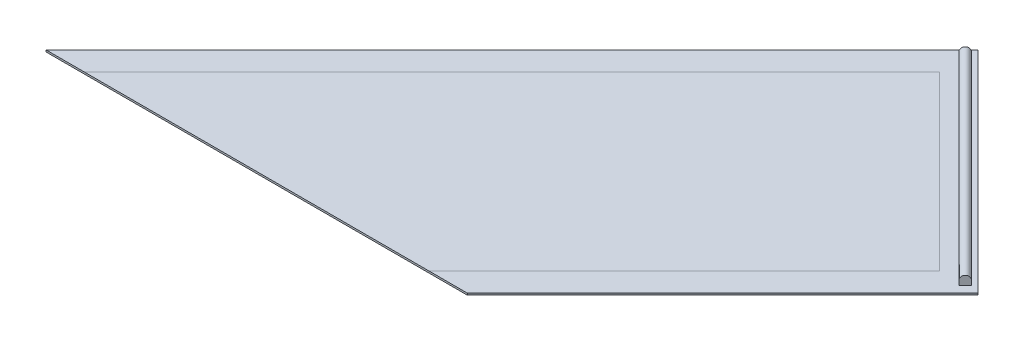
ISO-10303-21;
HEADER;
FILE_DESCRIPTION(('STEP AP214'),'2;1');
FILE_NAME('part.step','',(''),(''),'','','');
FILE_SCHEMA(('AUTOMOTIVE_DESIGN { 1 0 10303 214 1 1 1 1 }'));
ENDSEC;
DATA;
#1=APPLICATION_CONTEXT('core data for automotive mechanical design processes');
#2=APPLICATION_PROTOCOL_DEFINITION('international standard','automotive_design',2000,#1);
#3=PRODUCT_CONTEXT('',#1,'mechanical');
#4=PRODUCT('Part','Part','',(#3));
#5=PRODUCT_RELATED_PRODUCT_CATEGORY('part','',(#4));
#6=PRODUCT_DEFINITION_FORMATION('','',#4);
#7=PRODUCT_DEFINITION_CONTEXT('part definition',#1,'design');
#8=PRODUCT_DEFINITION('design','',#6,#7);
#9=PRODUCT_DEFINITION_SHAPE('','',#8);
#10=(LENGTH_UNIT() NAMED_UNIT(*) SI_UNIT(.MILLI.,.METRE.));
#11=(NAMED_UNIT(*) PLANE_ANGLE_UNIT() SI_UNIT($,.RADIAN.));
#12=(NAMED_UNIT(*) SI_UNIT($,.STERADIAN.) SOLID_ANGLE_UNIT());
#13=UNCERTAINTY_MEASURE_WITH_UNIT(LENGTH_MEASURE(1.E-05),#10,'distance_accuracy_value','');
#14=(GEOMETRIC_REPRESENTATION_CONTEXT(3) GLOBAL_UNCERTAINTY_ASSIGNED_CONTEXT((#13)) GLOBAL_UNIT_ASSIGNED_CONTEXT((#10,
#11,#12)) REPRESENTATION_CONTEXT('',''));
#15=CARTESIAN_POINT('',(0.,0.,0.));
#16=DIRECTION('',(0.,0.,1.));
#17=DIRECTION('',(1.,0.,0.));
#18=AXIS2_PLACEMENT_3D('',#15,#16,#17);
#19=CARTESIAN_POINT('',(0.,2.,0.));
#20=DIRECTION('',(0.,1.,0.));
#21=DIRECTION('',(0.,0.,1.));
#22=AXIS2_PLACEMENT_3D('',#19,#20,#21);
#23=PLANE('',#22);
#24=DIRECTION('',(-0.707106781186547,0.,-0.707106781186548));
#25=VECTOR('',#24,1.);
#26=CARTESIAN_POINT('',(-21.2132034355965,2.,21.2132034355964));
#27=LINE('',#26,#25);
#28=CARTESIAN_POINT('',(190.918830920368,2.,233.345237791561));
#29=VERTEX_POINT('',#28);
#30=CARTESIAN_POINT('',(0.,2.,42.4264068711929));
#31=VERTEX_POINT('',#30);
#32=EDGE_CURVE('E50',#29,#31,#27,.T.);
#33=ORIENTED_EDGE('',*,*,#32,.T.);
#34=DIRECTION('',(-0.707106781186548,0.,0.707106781186548));
#35=VECTOR('',#34,1.);
#36=CARTESIAN_POINT('',(21.2132034355964,2.,21.2132034355964));
#37=LINE('',#36,#35);
#38=CARTESIAN_POINT('',(-473.761543394988,2.,516.18795026618));
#39=VERTEX_POINT('',#38);
#40=EDGE_CURVE('E11',#31,#39,#37,.T.);
#41=ORIENTED_EDGE('',*,*,#40,.T.);
#42=DIRECTION('',(1.,0.,0.));
#43=VECTOR('',#42,1.);
#44=CARTESIAN_POINT('',(-516.18795026618,2.,516.18795026618));
#45=LINE('',#44,#43);
#46=CARTESIAN_POINT('',(-91.9238815542521,2.,516.18795026618));
#47=VERTEX_POINT('',#46);
#48=EDGE_CURVE('E139',#39,#47,#45,.T.);
#49=ORIENTED_EDGE('',*,*,#48,.T.);
#50=DIRECTION('',(0.707106781186549,0.,-0.707106781186546));
#51=VECTOR('',#50,1.);
#52=CARTESIAN_POINT('',(212.132034355964,2.,212.132034355965));
#53=LINE('',#52,#51);
#54=EDGE_CURVE('E162',#47,#29,#53,.T.);
#55=ORIENTED_EDGE('',*,*,#54,.T.);
#56=EDGE_LOOP('',(#33,#41,#49,#55));
#57=FACE_BOUND('',#56,.T.);
#58=ADVANCED_FACE('F41',(#57),#23,.T.);
#59=CARTESIAN_POINT('',(3.53553390593253,12.,10.6066017177984));
#60=DIRECTION('',(0.707106781186547,0.,0.707106781186548));
#61=DIRECTION('',(0.707106781186548,0.,-0.707106781186547));
#62=AXIS2_PLACEMENT_3D('',#59,#60,#61);
#63=PLANE('',#62);
#64=DIRECTION('',(0.,-1.,0.));
#65=VECTOR('',#64,1.);
#66=CARTESIAN_POINT('',(-3.53553390593296,12.,17.6776695296639));
#67=LINE('',#66,#65);
#68=CARTESIAN_POINT('',(-3.53553390593296,7.,17.6776695296639));
#69=VERTEX_POINT('',#68);
#70=CARTESIAN_POINT('',(-3.53553390593296,2.,17.6776695296639));
#71=VERTEX_POINT('',#70);
#72=EDGE_CURVE('E302',#69,#71,#67,.T.);
#73=ORIENTED_EDGE('',*,*,#72,.F.);
#74=CARTESIAN_POINT('',(-2.09034178855205E-13,7.,14.1421356237312));
#75=DIRECTION('',(-0.707106781186547,0.,-0.707106781186548));
#76=DIRECTION('',(-0.707106781186548,0.,0.707106781186547));
#77=AXIS2_PLACEMENT_3D('',#74,#75,#76);
#78=CIRCLE('',#77,5.);
#79=CARTESIAN_POINT('',(3.53553390593253,7.,10.6066017177984));
#80=VERTEX_POINT('',#79);
#81=EDGE_CURVE('E322',#69,#80,#78,.T.);
#82=ORIENTED_EDGE('',*,*,#81,.T.);
#83=DIRECTION('',(0.,-1.,0.));
#84=VECTOR('',#83,1.);
#85=CARTESIAN_POINT('',(3.53553390593253,12.,10.6066017177984));
#86=LINE('',#85,#84);
#87=CARTESIAN_POINT('',(3.53553390593253,2.,10.6066017177984));
#88=VERTEX_POINT('',#87);
#89=EDGE_CURVE('E159',#80,#88,#86,.T.);
#90=ORIENTED_EDGE('',*,*,#89,.T.);
#91=DIRECTION('',(-0.707106781186548,0.,0.707106781186547));
#92=VECTOR('',#91,1.);
#93=CARTESIAN_POINT('',(3.53553390593253,2.,10.6066017177984));
#94=LINE('',#93,#92);
#95=EDGE_CURVE('E314',#88,#71,#94,.T.);
#96=ORIENTED_EDGE('',*,*,#95,.T.);
#97=EDGE_LOOP('',(#73,#82,#90,#96));
#98=FACE_BOUND('',#97,.T.);
#99=ADVANCED_FACE('F174',(#98),#63,.F.);
#100=CARTESIAN_POINT('',(215.667568261897,12.,236.880771697493));
#101=DIRECTION('',(-0.707106781186548,0.,-0.707106781186548));
#102=DIRECTION('',(-0.707106781186548,0.,0.707106781186548));
#103=AXIS2_PLACEMENT_3D('',#100,#101,#102);
#104=PLANE('',#103);
#105=CARTESIAN_POINT('',(219.203102167829,7.,233.345237791561));
#106=DIRECTION('',(-0.707106781186548,0.,-0.707106781186548));
#107=DIRECTION('',(-0.707106781186548,0.,0.707106781186548));
#108=AXIS2_PLACEMENT_3D('',#105,#106,#107);
#109=CIRCLE('',#108,5.);
#110=CARTESIAN_POINT('',(222.738636073762,7.,229.809703885628));
#111=VERTEX_POINT('',#110);
#112=CARTESIAN_POINT('',(215.667568261897,7.,236.880771697493));
#113=VERTEX_POINT('',#112);
#114=EDGE_CURVE('E144',#111,#113,#109,.F.);
#115=ORIENTED_EDGE('',*,*,#114,.T.);
#116=DIRECTION('',(0.,-1.,0.));
#117=VECTOR('',#116,1.);
#118=CARTESIAN_POINT('',(215.667568261897,12.,236.880771697493));
#119=LINE('',#118,#117);
#120=CARTESIAN_POINT('',(215.667568261897,2.,236.880771697493));
#121=VERTEX_POINT('',#120);
#122=EDGE_CURVE('E304',#113,#121,#119,.T.);
#123=ORIENTED_EDGE('',*,*,#122,.T.);
#124=DIRECTION('',(0.707106781186548,0.,-0.707106781186548));
#125=VECTOR('',#124,1.);
#126=CARTESIAN_POINT('',(215.667568261897,2.,236.880771697493));
#127=LINE('',#126,#125);
#128=CARTESIAN_POINT('',(222.738636073762,2.,229.809703885628));
#129=VERTEX_POINT('',#128);
#130=EDGE_CURVE('E308',#121,#129,#127,.T.);
#131=ORIENTED_EDGE('',*,*,#130,.T.);
#132=DIRECTION('',(0.,-1.,0.));
#133=VECTOR('',#132,1.);
#134=CARTESIAN_POINT('',(222.738636073762,12.,229.809703885628));
#135=LINE('',#134,#133);
#136=EDGE_CURVE('E306',#111,#129,#135,.T.);
#137=ORIENTED_EDGE('',*,*,#136,.F.);
#138=EDGE_LOOP('',(#115,#123,#131,#137));
#139=FACE_BOUND('',#138,.T.);
#140=ADVANCED_FACE('F179',(#139),#104,.F.);
#141=CARTESIAN_POINT('',(222.738636073762,12.,229.809703885628));
#142=DIRECTION('',(-0.707106781186548,0.,0.707106781186548));
#143=DIRECTION('',(0.707106781186548,0.,0.707106781186548));
#144=AXIS2_PLACEMENT_3D('',#141,#142,#143);
#145=PLANE('',#144);
#146=DIRECTION('',(-0.707106781186547,0.,-0.707106781186548));
#147=VECTOR('',#146,1.);
#148=CARTESIAN_POINT('',(371.232060122938,7.,378.303127934804));
#149=LINE('',#148,#147);
#150=EDGE_CURVE('E320',#111,#80,#149,.T.);
#151=ORIENTED_EDGE('',*,*,#150,.F.);
#152=ORIENTED_EDGE('',*,*,#136,.T.);
#153=DIRECTION('',(-0.707106781186547,0.,-0.707106781186547));
#154=VECTOR('',#153,1.);
#155=CARTESIAN_POINT('',(222.738636073762,2.,229.809703885628));
#156=LINE('',#155,#154);
#157=EDGE_CURVE('E317',#129,#88,#156,.T.);
#158=ORIENTED_EDGE('',*,*,#157,.T.);
#159=ORIENTED_EDGE('',*,*,#89,.F.);
#160=EDGE_LOOP('',(#151,#152,#158,#159));
#161=FACE_BOUND('',#160,.T.);
#162=ADVANCED_FACE('F185',(#161),#145,.F.);
#163=ORIENTED_EDGE('',*,*,#40,.F.);
#164=ORIENTED_EDGE('',*,*,#32,.F.);
#165=ORIENTED_EDGE('',*,*,#54,.F.);
#166=CARTESIAN_POINT('',(-49.4974746830592,2.,516.18795026618));
#167=VERTEX_POINT('',#166);
#168=EDGE_CURVE('E142',#47,#167,#45,.T.);
#169=ORIENTED_EDGE('',*,*,#168,.T.);
#170=DIRECTION('',(0.707106781186549,0.,-0.707106781186546));
#171=VECTOR('',#170,1.);
#172=CARTESIAN_POINT('',(-49.4974746830592,2.,516.18795026618));
#173=LINE('',#172,#171);
#174=CARTESIAN_POINT('',(233.345237791561,2.,233.345237791561));
#175=VERTEX_POINT('',#174);
#176=EDGE_CURVE('E161',#167,#175,#173,.T.);
#177=ORIENTED_EDGE('',*,*,#176,.T.);
#178=DIRECTION('',(-0.707106781186547,0.,-0.707106781186548));
#179=VECTOR('',#178,1.);
#180=CARTESIAN_POINT('',(0.,2.,0.));
#181=LINE('',#180,#179);
#182=CARTESIAN_POINT('',(0.,2.,0.));
#183=VERTEX_POINT('',#182);
#184=EDGE_CURVE('E119',#175,#183,#181,.T.);
#185=ORIENTED_EDGE('',*,*,#184,.T.);
#186=DIRECTION('',(-0.707106781186548,0.,0.707106781186547));
#187=VECTOR('',#186,1.);
#188=CARTESIAN_POINT('',(0.,2.,0.));
#189=LINE('',#188,#187);
#190=CARTESIAN_POINT('',(-516.18795026618,2.,516.18795026618));
#191=VERTEX_POINT('',#190);
#192=EDGE_CURVE('E112',#183,#191,#189,.T.);
#193=ORIENTED_EDGE('',*,*,#192,.T.);
#194=EDGE_CURVE('E117',#191,#39,#45,.T.);
#195=ORIENTED_EDGE('',*,*,#194,.T.);
#196=EDGE_LOOP('',(#163,#164,#165,#169,#177,#185,#193,#195));
#197=FACE_BOUND('',#196,.T.);
#198=ORIENTED_EDGE('',*,*,#95,.F.);
#199=ORIENTED_EDGE('',*,*,#157,.F.);
#200=ORIENTED_EDGE('',*,*,#130,.F.);
#201=DIRECTION('',(0.707106781186548,0.,0.707106781186547));
#202=VECTOR('',#201,1.);
#203=CARTESIAN_POINT('',(-3.53553390593296,2.,17.6776695296639));
#204=LINE('',#203,#202);
#205=EDGE_CURVE('E311',#71,#121,#204,.T.);
#206=ORIENTED_EDGE('',*,*,#205,.F.);
#207=EDGE_LOOP('',(#198,#199,#200,#206));
#208=FACE_BOUND('',#207,.T.);
#209=ADVANCED_FACE('F114',(#197,#208),#23,.T.);
#210=CARTESIAN_POINT('',(-49.4974746830592,2.,516.18795026618));
#211=DIRECTION('',(-0.707106781186546,0.,-0.707106781186549));
#212=DIRECTION('',(-0.707106781186549,0.,0.707106781186546));
#213=AXIS2_PLACEMENT_3D('',#210,#211,#212);
#214=PLANE('',#213);
#215=DIRECTION('',(0.707106781186549,0.,-0.707106781186546));
#216=VECTOR('',#215,1.);
#217=CARTESIAN_POINT('',(-49.4974746830592,0.,516.18795026618));
#218=LINE('',#217,#216);
#219=CARTESIAN_POINT('',(-49.4974746830592,0.,516.18795026618));
#220=VERTEX_POINT('',#219);
#221=CARTESIAN_POINT('',(233.345237791561,0.,233.345237791561));
#222=VERTEX_POINT('',#221);
#223=EDGE_CURVE('E154',#220,#222,#218,.T.);
#224=ORIENTED_EDGE('',*,*,#223,.T.);
#225=DIRECTION('',(0.,-1.,0.));
#226=VECTOR('',#225,1.);
#227=CARTESIAN_POINT('',(233.345237791561,2.,233.345237791561));
#228=LINE('',#227,#226);
#229=EDGE_CURVE('E163',#175,#222,#228,.T.);
#230=ORIENTED_EDGE('',*,*,#229,.F.);
#231=ORIENTED_EDGE('',*,*,#176,.F.);
#232=DIRECTION('',(0.,-1.,0.));
#233=VECTOR('',#232,1.);
#234=CARTESIAN_POINT('',(-49.4974746830592,2.,516.18795026618));
#235=LINE('',#234,#233);
#236=EDGE_CURVE('E150',#167,#220,#235,.T.);
#237=ORIENTED_EDGE('',*,*,#236,.T.);
#238=EDGE_LOOP('',(#224,#230,#231,#237));
#239=FACE_BOUND('',#238,.T.);
#240=ADVANCED_FACE('F43',(#239),#214,.F.);
#241=CARTESIAN_POINT('',(0.,2.,0.));
#242=DIRECTION('',(-0.707106781186548,0.,0.707106781186547));
#243=DIRECTION('',(0.707106781186547,0.,0.707106781186548));
#244=AXIS2_PLACEMENT_3D('',#241,#242,#243);
#245=PLANE('',#244);
#246=DIRECTION('',(-0.707106781186547,0.,-0.707106781186548));
#247=VECTOR('',#246,1.);
#248=CARTESIAN_POINT('',(0.,0.,0.));
#249=LINE('',#248,#247);
#250=CARTESIAN_POINT('',(0.,0.,0.));
#251=VERTEX_POINT('',#250);
#252=EDGE_CURVE('E155',#222,#251,#249,.T.);
#253=ORIENTED_EDGE('',*,*,#252,.T.);
#254=DIRECTION('',(0.,-1.,0.));
#255=VECTOR('',#254,1.);
#256=CARTESIAN_POINT('',(0.,2.,0.));
#257=LINE('',#256,#255);
#258=EDGE_CURVE('E123',#183,#251,#257,.T.);
#259=ORIENTED_EDGE('',*,*,#258,.F.);
#260=ORIENTED_EDGE('',*,*,#184,.F.);
#261=ORIENTED_EDGE('',*,*,#229,.T.);
#262=EDGE_LOOP('',(#253,#259,#260,#261));
#263=FACE_BOUND('',#262,.T.);
#264=ADVANCED_FACE('F190',(#263),#245,.F.);
#265=CARTESIAN_POINT('',(0.,2.,0.));
#266=DIRECTION('',(0.707106781186547,0.,0.707106781186548));
#267=DIRECTION('',(0.707106781186548,0.,-0.707106781186547));
#268=AXIS2_PLACEMENT_3D('',#265,#266,#267);
#269=PLANE('',#268);
#270=DIRECTION('',(-0.707106781186548,0.,0.707106781186547));
#271=VECTOR('',#270,1.);
#272=CARTESIAN_POINT('',(0.,0.,0.));
#273=LINE('',#272,#271);
#274=CARTESIAN_POINT('',(-516.18795026618,0.,516.18795026618));
#275=VERTEX_POINT('',#274);
#276=EDGE_CURVE('E129',#251,#275,#273,.T.);
#277=ORIENTED_EDGE('',*,*,#276,.T.);
#278=DIRECTION('',(0.,-1.,0.));
#279=VECTOR('',#278,1.);
#280=CARTESIAN_POINT('',(-516.18795026618,523.775813927783,516.18795026618));
#281=LINE('',#280,#279);
#282=EDGE_CURVE('E126',#191,#275,#281,.T.);
#283=ORIENTED_EDGE('',*,*,#282,.F.);
#284=ORIENTED_EDGE('',*,*,#192,.F.);
#285=ORIENTED_EDGE('',*,*,#258,.T.);
#286=EDGE_LOOP('',(#277,#283,#284,#285));
#287=FACE_BOUND('',#286,.T.);
#288=ADVANCED_FACE('F127',(#287),#269,.F.);
#289=CARTESIAN_POINT('',(0.,0.,0.));
#290=DIRECTION('',(0.,1.,0.));
#291=DIRECTION('',(0.,0.,1.));
#292=AXIS2_PLACEMENT_3D('',#289,#290,#291);
#293=PLANE('',#292);
#294=ORIENTED_EDGE('',*,*,#223,.F.);
#295=DIRECTION('',(1.,0.,0.));
#296=VECTOR('',#295,1.);
#297=CARTESIAN_POINT('',(-516.18795026618,0.,516.18795026618));
#298=LINE('',#297,#296);
#299=EDGE_CURVE('E133',#275,#220,#298,.T.);
#300=ORIENTED_EDGE('',*,*,#299,.F.);
#301=ORIENTED_EDGE('',*,*,#276,.F.);
#302=ORIENTED_EDGE('',*,*,#252,.F.);
#303=EDGE_LOOP('',(#294,#300,#301,#302));
#304=FACE_BOUND('',#303,.T.);
#305=ADVANCED_FACE('F152',(#304),#293,.F.);
#306=CARTESIAN_POINT('',(-3.53553390593296,12.,17.6776695296639));
#307=DIRECTION('',(0.707106781186547,0.,-0.707106781186548));
#308=DIRECTION('',(-0.707106781186548,0.,-0.707106781186547));
#309=AXIS2_PLACEMENT_3D('',#306,#307,#308);
#310=PLANE('',#309);
#311=ORIENTED_EDGE('',*,*,#122,.F.);
#312=DIRECTION('',(-0.707106781186547,0.,-0.707106781186548));
#313=VECTOR('',#312,1.);
#314=CARTESIAN_POINT('',(364.160992311072,7.,385.374195746669));
#315=LINE('',#314,#313);
#316=EDGE_CURVE('E140',#113,#69,#315,.T.);
#317=ORIENTED_EDGE('',*,*,#316,.T.);
#318=ORIENTED_EDGE('',*,*,#72,.T.);
#319=ORIENTED_EDGE('',*,*,#205,.T.);
#320=EDGE_LOOP('',(#311,#317,#318,#319));
#321=FACE_BOUND('',#320,.T.);
#322=ADVANCED_FACE('F199',(#321),#310,.F.);
#323=CARTESIAN_POINT('',(367.696526217005,7.,381.838661840737));
#324=DIRECTION('',(-0.707106781186547,0.,-0.707106781186548));
#325=DIRECTION('',(-0.707106781186548,0.,0.707106781186547));
#326=AXIS2_PLACEMENT_3D('',#323,#324,#325);
#327=CYLINDRICAL_SURFACE('',#326,5.);
#328=ORIENTED_EDGE('',*,*,#150,.T.);
#329=ORIENTED_EDGE('',*,*,#81,.F.);
#330=ORIENTED_EDGE('',*,*,#316,.F.);
#331=ORIENTED_EDGE('',*,*,#114,.F.);
#332=EDGE_LOOP('',(#328,#329,#330,#331));
#333=FACE_BOUND('',#332,.T.);
#334=ADVANCED_FACE('F201',(#333),#327,.T.);
#335=CARTESIAN_POINT('',(-516.18795026618,523.775813927783,516.18795026618));
#336=DIRECTION('',(0.,0.,-1.));
#337=DIRECTION('',(-1.,0.,0.));
#338=AXIS2_PLACEMENT_3D('',#335,#336,#337);
#339=PLANE('',#338);
#340=ORIENTED_EDGE('',*,*,#194,.F.);
#341=ORIENTED_EDGE('',*,*,#282,.T.);
#342=ORIENTED_EDGE('',*,*,#299,.T.);
#343=ORIENTED_EDGE('',*,*,#236,.F.);
#344=ORIENTED_EDGE('',*,*,#168,.F.);
#345=ORIENTED_EDGE('',*,*,#48,.F.);
#346=EDGE_LOOP('',(#340,#341,#342,#343,#344,#345));
#347=FACE_BOUND('',#346,.T.);
#348=ADVANCED_FACE('F136',(#347),#339,.F.);
#349=CLOSED_SHELL('',(#58,#99,#140,#162,#209,#240,#264,#288,#305,#322,#334,#348));
#350=MANIFOLD_SOLID_BREP('B2',#349);
#351=ADVANCED_BREP_SHAPE_REPRESENTATION('',(#18,#350),#14);
#352=SHAPE_DEFINITION_REPRESENTATION(#9,#351);
ENDSEC;
END-ISO-10303-21;
